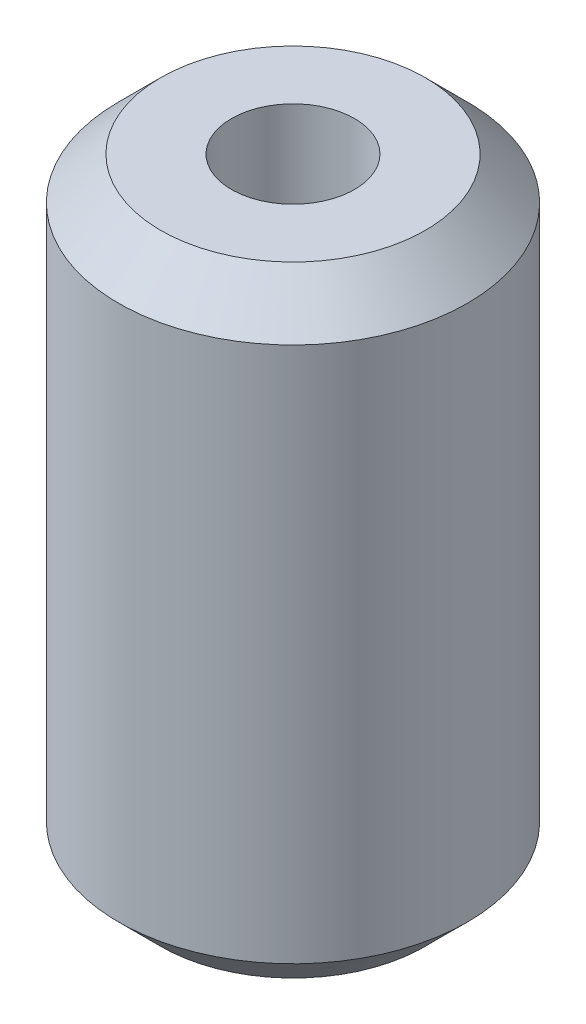
ISO-10303-21;
HEADER;
FILE_DESCRIPTION(('STEP AP214'),'2;1');
FILE_NAME('part.step','',(''),(''),'','','');
FILE_SCHEMA(('AUTOMOTIVE_DESIGN { 1 0 10303 214 1 1 1 1 }'));
ENDSEC;
DATA;
#1=APPLICATION_CONTEXT('core data for automotive mechanical design processes');
#2=APPLICATION_PROTOCOL_DEFINITION('international standard','automotive_design',2000,#1);
#3=PRODUCT_CONTEXT('',#1,'mechanical');
#4=PRODUCT('Part','Part','',(#3));
#5=PRODUCT_RELATED_PRODUCT_CATEGORY('part','',(#4));
#6=PRODUCT_DEFINITION_FORMATION('','',#4);
#7=PRODUCT_DEFINITION_CONTEXT('part definition',#1,'design');
#8=PRODUCT_DEFINITION('design','',#6,#7);
#9=PRODUCT_DEFINITION_SHAPE('','',#8);
#10=(LENGTH_UNIT() NAMED_UNIT(*) SI_UNIT(.MILLI.,.METRE.));
#11=(NAMED_UNIT(*) PLANE_ANGLE_UNIT() SI_UNIT($,.RADIAN.));
#12=(NAMED_UNIT(*) SI_UNIT($,.STERADIAN.) SOLID_ANGLE_UNIT());
#13=UNCERTAINTY_MEASURE_WITH_UNIT(LENGTH_MEASURE(1.E-05),#10,'distance_accuracy_value','');
#14=(GEOMETRIC_REPRESENTATION_CONTEXT(3) GLOBAL_UNCERTAINTY_ASSIGNED_CONTEXT((#13)) GLOBAL_UNIT_ASSIGNED_CONTEXT((#10,
#11,#12)) REPRESENTATION_CONTEXT('',''));
#15=CARTESIAN_POINT('',(0.,0.,0.));
#16=DIRECTION('',(0.,0.,1.));
#17=DIRECTION('',(1.,0.,0.));
#18=AXIS2_PLACEMENT_3D('',#15,#16,#17);
#19=CARTESIAN_POINT('',(0.,16.5429587446719,0.));
#20=DIRECTION('',(0.,1.,0.));
#21=DIRECTION('',(-1.,0.,0.));
#22=AXIS2_PLACEMENT_3D('',#19,#20,#21);
#23=CYLINDRICAL_SURFACE('',#22,3.175);
#24=CARTESIAN_POINT('',(0.,16.5429587446719,0.));
#25=DIRECTION('',(0.,1.,0.));
#26=DIRECTION('',(-1.,0.,0.));
#27=AXIS2_PLACEMENT_3D('',#24,#25,#26);
#28=CIRCLE('',#27,3.175);
#29=CARTESIAN_POINT('',(-3.175,16.5429587446719,0.));
#30=VERTEX_POINT('',#29);
#31=EDGE_CURVE('E57',#30,#30,#28,.T.);
#32=ORIENTED_EDGE('',*,*,#31,.T.);
#33=EDGE_LOOP('',(#32));
#34=FACE_BOUND('',#33,.T.);
#35=CARTESIAN_POINT('',(0.,-15.4570412553281,0.));
#36=DIRECTION('',(0.,1.,0.));
#37=DIRECTION('',(-1.,0.,0.));
#38=AXIS2_PLACEMENT_3D('',#35,#36,#37);
#39=CIRCLE('',#38,3.175);
#40=CARTESIAN_POINT('',(-3.175,-15.4570412553281,0.));
#41=VERTEX_POINT('',#40);
#42=EDGE_CURVE('E10',#41,#41,#39,.T.);
#43=ORIENTED_EDGE('',*,*,#42,.F.);
#44=EDGE_LOOP('',(#43));
#45=FACE_BOUND('',#44,.T.);
#46=ADVANCED_FACE('F35',(#34,#45),#23,.F.);
#47=CARTESIAN_POINT('',(-3.175,-15.4570412553281,0.));
#48=DIRECTION('',(0.,-1.,0.));
#49=DIRECTION('',(1.,0.,0.));
#50=AXIS2_PLACEMENT_3D('',#47,#48,#49);
#51=PLANE('',#50);
#52=ORIENTED_EDGE('',*,*,#42,.T.);
#53=EDGE_LOOP('',(#52));
#54=FACE_BOUND('',#53,.T.);
#55=CARTESIAN_POINT('',(0.,-15.4570412553281,0.));
#56=DIRECTION('',(0.,1.,0.));
#57=DIRECTION('',(-1.,0.,0.));
#58=AXIS2_PLACEMENT_3D('',#55,#56,#57);
#59=CIRCLE('',#58,6.82767275881768);
#60=CARTESIAN_POINT('',(-6.82767275881768,-15.4570412553281,0.));
#61=VERTEX_POINT('',#60);
#62=EDGE_CURVE('E41',#61,#61,#59,.T.);
#63=ORIENTED_EDGE('',*,*,#62,.F.);
#64=EDGE_LOOP('',(#63));
#65=FACE_BOUND('',#64,.T.);
#66=ADVANCED_FACE('F75',(#54,#65),#51,.T.);
#67=CARTESIAN_POINT('',(0.,-13.2847140141458,0.));
#68=DIRECTION('',(0.,1.,0.));
#69=DIRECTION('',(-1.,0.,0.));
#70=AXIS2_PLACEMENT_3D('',#67,#68,#69);
#71=CONICAL_SURFACE('',#70,9.,0.785398163397449);
#72=ORIENTED_EDGE('',*,*,#62,.T.);
#73=EDGE_LOOP('',(#72));
#74=FACE_BOUND('',#73,.T.);
#75=CARTESIAN_POINT('',(0.,-13.2847140141458,0.));
#76=DIRECTION('',(0.,1.,0.));
#77=DIRECTION('',(-1.,0.,0.));
#78=AXIS2_PLACEMENT_3D('',#75,#76,#77);
#79=CIRCLE('',#78,9.);
#80=CARTESIAN_POINT('',(-9.,-13.2847140141458,0.));
#81=VERTEX_POINT('',#80);
#82=EDGE_CURVE('E45',#81,#81,#79,.T.);
#83=ORIENTED_EDGE('',*,*,#82,.F.);
#84=EDGE_LOOP('',(#83));
#85=FACE_BOUND('',#84,.T.);
#86=ADVANCED_FACE('F79',(#74,#85),#71,.T.);
#87=CARTESIAN_POINT('',(0.,16.5429587446719,0.));
#88=DIRECTION('',(0.,1.,0.));
#89=DIRECTION('',(-1.,0.,0.));
#90=AXIS2_PLACEMENT_3D('',#87,#88,#89);
#91=CYLINDRICAL_SURFACE('',#90,9.);
#92=ORIENTED_EDGE('',*,*,#82,.T.);
#93=EDGE_LOOP('',(#92));
#94=FACE_BOUND('',#93,.T.);
#95=CARTESIAN_POINT('',(0.,14.3706315034895,0.));
#96=DIRECTION('',(0.,1.,0.));
#97=DIRECTION('',(-1.,0.,0.));
#98=AXIS2_PLACEMENT_3D('',#95,#96,#97);
#99=CIRCLE('',#98,9.);
#100=CARTESIAN_POINT('',(-9.,14.3706315034895,0.));
#101=VERTEX_POINT('',#100);
#102=EDGE_CURVE('E49',#101,#101,#99,.T.);
#103=ORIENTED_EDGE('',*,*,#102,.F.);
#104=EDGE_LOOP('',(#103));
#105=FACE_BOUND('',#104,.T.);
#106=ADVANCED_FACE('F71',(#94,#105),#91,.T.);
#107=CARTESIAN_POINT('',(0.,16.5429587446719,0.));
#108=DIRECTION('',(0.,-1.,0.));
#109=DIRECTION('',(1.,0.,0.));
#110=AXIS2_PLACEMENT_3D('',#107,#108,#109);
#111=CONICAL_SURFACE('',#110,6.82767275881769,0.785398163397446);
#112=ORIENTED_EDGE('',*,*,#102,.T.);
#113=EDGE_LOOP('',(#112));
#114=FACE_BOUND('',#113,.T.);
#115=CARTESIAN_POINT('',(0.,16.5429587446719,0.));
#116=DIRECTION('',(0.,1.,0.));
#117=DIRECTION('',(-1.,0.,0.));
#118=AXIS2_PLACEMENT_3D('',#115,#116,#117);
#119=CIRCLE('',#118,6.82767275881769);
#120=CARTESIAN_POINT('',(-6.82767275881769,16.5429587446719,0.));
#121=VERTEX_POINT('',#120);
#122=EDGE_CURVE('E54',#121,#121,#119,.T.);
#123=ORIENTED_EDGE('',*,*,#122,.F.);
#124=EDGE_LOOP('',(#123));
#125=FACE_BOUND('',#124,.T.);
#126=ADVANCED_FACE('F65',(#114,#125),#111,.T.);
#127=CARTESIAN_POINT('',(-6.82767275881769,16.5429587446719,0.));
#128=DIRECTION('',(0.,1.,0.));
#129=DIRECTION('',(-1.,0.,0.));
#130=AXIS2_PLACEMENT_3D('',#127,#128,#129);
#131=PLANE('',#130);
#132=ORIENTED_EDGE('',*,*,#122,.T.);
#133=EDGE_LOOP('',(#132));
#134=FACE_BOUND('',#133,.T.);
#135=ORIENTED_EDGE('',*,*,#31,.F.);
#136=EDGE_LOOP('',(#135));
#137=FACE_BOUND('',#136,.T.);
#138=ADVANCED_FACE('F63',(#134,#137),#131,.T.);
#139=CLOSED_SHELL('',(#46,#66,#86,#106,#126,#138));
#140=MANIFOLD_SOLID_BREP('B2',#139);
#141=ADVANCED_BREP_SHAPE_REPRESENTATION('',(#18,#140),#14);
#142=SHAPE_DEFINITION_REPRESENTATION(#9,#141);
ENDSEC;
END-ISO-10303-21;
